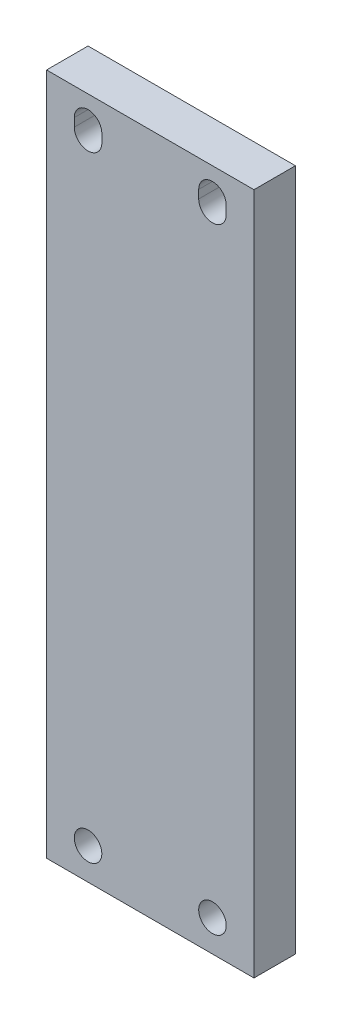
ISO-10303-21;
HEADER;
FILE_DESCRIPTION(('STEP AP214'),'2;1');
FILE_NAME('part.step','',(''),(''),'','','');
FILE_SCHEMA(('AUTOMOTIVE_DESIGN { 1 0 10303 214 1 1 1 1 }'));
ENDSEC;
DATA;
#1=APPLICATION_CONTEXT('core data for automotive mechanical design processes');
#2=APPLICATION_PROTOCOL_DEFINITION('international standard','automotive_design',2000,#1);
#3=PRODUCT_CONTEXT('',#1,'mechanical');
#4=PRODUCT('Part','Part','',(#3));
#5=PRODUCT_RELATED_PRODUCT_CATEGORY('part','',(#4));
#6=PRODUCT_DEFINITION_FORMATION('','',#4);
#7=PRODUCT_DEFINITION_CONTEXT('part definition',#1,'design');
#8=PRODUCT_DEFINITION('design','',#6,#7);
#9=PRODUCT_DEFINITION_SHAPE('','',#8);
#10=(LENGTH_UNIT() NAMED_UNIT(*) SI_UNIT(.MILLI.,.METRE.));
#11=(NAMED_UNIT(*) PLANE_ANGLE_UNIT() SI_UNIT($,.RADIAN.));
#12=(NAMED_UNIT(*) SI_UNIT($,.STERADIAN.) SOLID_ANGLE_UNIT());
#13=UNCERTAINTY_MEASURE_WITH_UNIT(LENGTH_MEASURE(1.E-05),#10,'distance_accuracy_value','');
#14=(GEOMETRIC_REPRESENTATION_CONTEXT(3) GLOBAL_UNCERTAINTY_ASSIGNED_CONTEXT((#13)) GLOBAL_UNIT_ASSIGNED_CONTEXT((#10,
#11,#12)) REPRESENTATION_CONTEXT('',''));
#15=CARTESIAN_POINT('',(0.,0.,0.));
#16=DIRECTION('',(0.,0.,1.));
#17=DIRECTION('',(1.,0.,0.));
#18=AXIS2_PLACEMENT_3D('',#15,#16,#17);
#19=CARTESIAN_POINT('',(-31.75,104.521,6.35));
#20=DIRECTION('',(1.,0.,0.));
#21=DIRECTION('',(0.,1.,0.));
#22=AXIS2_PLACEMENT_3D('',#19,#20,#21);
#23=PLANE('',#22);
#24=DIRECTION('',(0.,-1.,0.));
#25=VECTOR('',#24,1.);
#26=CARTESIAN_POINT('',(-31.75,104.521,-6.35));
#27=LINE('',#26,#25);
#28=CARTESIAN_POINT('',(-31.75,104.521,-6.35));
#29=VERTEX_POINT('',#28);
#30=CARTESIAN_POINT('',(-31.75,-104.521,-6.35));
#31=VERTEX_POINT('',#30);
#32=EDGE_CURVE('E217',#29,#31,#27,.T.);
#33=ORIENTED_EDGE('',*,*,#32,.T.);
#34=DIRECTION('',(0.,0.,-1.));
#35=VECTOR('',#34,1.);
#36=CARTESIAN_POINT('',(-31.75,-104.521,6.35));
#37=LINE('',#36,#35);
#38=CARTESIAN_POINT('',(-31.75,-104.521,6.35));
#39=VERTEX_POINT('',#38);
#40=EDGE_CURVE('E13',#39,#31,#37,.T.);
#41=ORIENTED_EDGE('',*,*,#40,.F.);
#42=DIRECTION('',(0.,-1.,0.));
#43=VECTOR('',#42,1.);
#44=CARTESIAN_POINT('',(-31.75,104.521,6.35));
#45=LINE('',#44,#43);
#46=CARTESIAN_POINT('',(-31.75,104.521,6.35));
#47=VERTEX_POINT('',#46);
#48=EDGE_CURVE('E218',#47,#39,#45,.T.);
#49=ORIENTED_EDGE('',*,*,#48,.F.);
#50=DIRECTION('',(0.,0.,-1.));
#51=VECTOR('',#50,1.);
#52=CARTESIAN_POINT('',(-31.75,104.521,6.35));
#53=LINE('',#52,#51);
#54=EDGE_CURVE('E228',#47,#29,#53,.T.);
#55=ORIENTED_EDGE('',*,*,#54,.T.);
#56=EDGE_LOOP('',(#33,#41,#49,#55));
#57=FACE_BOUND('',#56,.T.);
#58=ADVANCED_FACE('F49',(#57),#23,.F.);
#59=CARTESIAN_POINT('',(-31.75,-104.521,6.35));
#60=DIRECTION('',(0.,1.,0.));
#61=DIRECTION('',(0.,0.,1.));
#62=AXIS2_PLACEMENT_3D('',#59,#60,#61);
#63=PLANE('',#62);
#64=DIRECTION('',(1.,0.,0.));
#65=VECTOR('',#64,1.);
#66=CARTESIAN_POINT('',(-31.75,-104.521,-6.35));
#67=LINE('',#66,#65);
#68=CARTESIAN_POINT('',(31.75,-104.521,-6.35));
#69=VERTEX_POINT('',#68);
#70=EDGE_CURVE('E231',#31,#69,#67,.T.);
#71=ORIENTED_EDGE('',*,*,#70,.T.);
#72=DIRECTION('',(0.,0.,-1.));
#73=VECTOR('',#72,1.);
#74=CARTESIAN_POINT('',(31.75,-104.521,6.35));
#75=LINE('',#74,#73);
#76=CARTESIAN_POINT('',(31.75,-104.521,6.35));
#77=VERTEX_POINT('',#76);
#78=EDGE_CURVE('E56',#77,#69,#75,.T.);
#79=ORIENTED_EDGE('',*,*,#78,.F.);
#80=DIRECTION('',(1.,0.,0.));
#81=VECTOR('',#80,1.);
#82=CARTESIAN_POINT('',(-31.75,-104.521,6.35));
#83=LINE('',#82,#81);
#84=EDGE_CURVE('E221',#39,#77,#83,.T.);
#85=ORIENTED_EDGE('',*,*,#84,.F.);
#86=ORIENTED_EDGE('',*,*,#40,.T.);
#87=EDGE_LOOP('',(#71,#79,#85,#86));
#88=FACE_BOUND('',#87,.T.);
#89=ADVANCED_FACE('F260',(#88),#63,.F.);
#90=CARTESIAN_POINT('',(31.75,104.521,6.35));
#91=DIRECTION('',(-1.,0.,0.));
#92=DIRECTION('',(0.,-1.,0.));
#93=AXIS2_PLACEMENT_3D('',#90,#91,#92);
#94=PLANE('',#93);
#95=DIRECTION('',(0.,1.,0.));
#96=VECTOR('',#95,1.);
#97=CARTESIAN_POINT('',(31.75,104.521,-6.35));
#98=LINE('',#97,#96);
#99=CARTESIAN_POINT('',(31.75,104.521,-6.35));
#100=VERTEX_POINT('',#99);
#101=EDGE_CURVE('E233',#69,#100,#98,.T.);
#102=ORIENTED_EDGE('',*,*,#101,.T.);
#103=DIRECTION('',(0.,0.,-1.));
#104=VECTOR('',#103,1.);
#105=CARTESIAN_POINT('',(31.75,104.521,6.35));
#106=LINE('',#105,#104);
#107=CARTESIAN_POINT('',(31.75,104.521,6.35));
#108=VERTEX_POINT('',#107);
#109=EDGE_CURVE('E238',#108,#100,#106,.T.);
#110=ORIENTED_EDGE('',*,*,#109,.F.);
#111=DIRECTION('',(0.,1.,0.));
#112=VECTOR('',#111,1.);
#113=CARTESIAN_POINT('',(31.75,104.521,6.35));
#114=LINE('',#113,#112);
#115=EDGE_CURVE('E224',#77,#108,#114,.T.);
#116=ORIENTED_EDGE('',*,*,#115,.F.);
#117=ORIENTED_EDGE('',*,*,#78,.T.);
#118=EDGE_LOOP('',(#102,#110,#116,#117));
#119=FACE_BOUND('',#118,.T.);
#120=ADVANCED_FACE('F245',(#119),#94,.F.);
#121=CARTESIAN_POINT('',(-31.75,104.521,6.35));
#122=DIRECTION('',(0.,-1.,0.));
#123=DIRECTION('',(0.,0.,-1.));
#124=AXIS2_PLACEMENT_3D('',#121,#122,#123);
#125=PLANE('',#124);
#126=DIRECTION('',(-1.,0.,0.));
#127=VECTOR('',#126,1.);
#128=CARTESIAN_POINT('',(-31.75,104.521,-6.35));
#129=LINE('',#128,#127);
#130=EDGE_CURVE('E222',#100,#29,#129,.T.);
#131=ORIENTED_EDGE('',*,*,#130,.T.);
#132=ORIENTED_EDGE('',*,*,#54,.F.);
#133=DIRECTION('',(-1.,0.,0.));
#134=VECTOR('',#133,1.);
#135=CARTESIAN_POINT('',(-31.75,104.521,6.35));
#136=LINE('',#135,#134);
#137=EDGE_CURVE('E226',#108,#47,#136,.T.);
#138=ORIENTED_EDGE('',*,*,#137,.F.);
#139=ORIENTED_EDGE('',*,*,#109,.T.);
#140=EDGE_LOOP('',(#131,#132,#138,#139));
#141=FACE_BOUND('',#140,.T.);
#142=ADVANCED_FACE('F253',(#141),#125,.F.);
#143=CARTESIAN_POINT('',(0.,0.,6.35));
#144=DIRECTION('',(0.,0.,1.));
#145=DIRECTION('',(1.,0.,0.));
#146=AXIS2_PLACEMENT_3D('',#143,#144,#145);
#147=PLANE('',#146);
#148=CARTESIAN_POINT('',(19.05,93.599,6.35));
#149=DIRECTION('',(0.,0.,1.));
#150=DIRECTION('',(-1.,0.,0.));
#151=AXIS2_PLACEMENT_3D('',#148,#149,#150);
#152=CIRCLE('',#151,4.2164);
#153=CARTESIAN_POINT('',(14.8336,93.599,6.35));
#154=VERTEX_POINT('',#153);
#155=CARTESIAN_POINT('',(23.2664,93.599,6.35));
#156=VERTEX_POINT('',#155);
#157=EDGE_CURVE('E63',#154,#156,#152,.T.);
#158=ORIENTED_EDGE('',*,*,#157,.F.);
#159=DIRECTION('',(0.,-1.,0.));
#160=VECTOR('',#159,1.);
#161=CARTESIAN_POINT('',(14.8336,93.599,6.35));
#162=LINE('',#161,#160);
#163=CARTESIAN_POINT('',(14.8336,96.139,6.35));
#164=VERTEX_POINT('',#163);
#165=EDGE_CURVE('E155',#164,#154,#162,.T.);
#166=ORIENTED_EDGE('',*,*,#165,.F.);
#167=CARTESIAN_POINT('',(19.05,96.139,6.35));
#168=DIRECTION('',(0.,0.,1.));
#169=DIRECTION('',(-1.,0.,0.));
#170=AXIS2_PLACEMENT_3D('',#167,#168,#169);
#171=CIRCLE('',#170,4.2164);
#172=CARTESIAN_POINT('',(23.2664,96.139,6.35));
#173=VERTEX_POINT('',#172);
#174=EDGE_CURVE('E158',#173,#164,#171,.T.);
#175=ORIENTED_EDGE('',*,*,#174,.F.);
#176=DIRECTION('',(0.,1.,0.));
#177=VECTOR('',#176,1.);
#178=CARTESIAN_POINT('',(23.2664,93.599,6.35));
#179=LINE('',#178,#177);
#180=EDGE_CURVE('E164',#156,#173,#179,.T.);
#181=ORIENTED_EDGE('',*,*,#180,.F.);
#182=EDGE_LOOP('',(#158,#166,#175,#181));
#183=FACE_BOUND('',#182,.T.);
#184=CARTESIAN_POINT('',(-19.05,93.599,6.35));
#185=DIRECTION('',(0.,0.,1.));
#186=DIRECTION('',(1.,0.,0.));
#187=AXIS2_PLACEMENT_3D('',#184,#185,#186);
#188=CIRCLE('',#187,4.2164);
#189=CARTESIAN_POINT('',(-23.2664,93.599,6.35));
#190=VERTEX_POINT('',#189);
#191=CARTESIAN_POINT('',(-14.8336,93.599,6.35));
#192=VERTEX_POINT('',#191);
#193=EDGE_CURVE('E170',#190,#192,#188,.T.);
#194=ORIENTED_EDGE('',*,*,#193,.F.);
#195=DIRECTION('',(0.,-1.,0.));
#196=VECTOR('',#195,1.);
#197=CARTESIAN_POINT('',(-23.2664,93.599,6.35));
#198=LINE('',#197,#196);
#199=CARTESIAN_POINT('',(-23.2664,96.139,6.35));
#200=VERTEX_POINT('',#199);
#201=EDGE_CURVE('E178',#200,#190,#198,.T.);
#202=ORIENTED_EDGE('',*,*,#201,.F.);
#203=CARTESIAN_POINT('',(-19.05,96.139,6.35));
#204=DIRECTION('',(0.,0.,1.));
#205=DIRECTION('',(1.,0.,0.));
#206=AXIS2_PLACEMENT_3D('',#203,#204,#205);
#207=CIRCLE('',#206,4.2164);
#208=CARTESIAN_POINT('',(-14.8336,96.139,6.35));
#209=VERTEX_POINT('',#208);
#210=EDGE_CURVE('E192',#209,#200,#207,.T.);
#211=ORIENTED_EDGE('',*,*,#210,.F.);
#212=DIRECTION('',(0.,1.,0.));
#213=VECTOR('',#212,1.);
#214=CARTESIAN_POINT('',(-14.8336,93.599,6.35));
#215=LINE('',#214,#213);
#216=EDGE_CURVE('E189',#192,#209,#215,.T.);
#217=ORIENTED_EDGE('',*,*,#216,.F.);
#218=EDGE_LOOP('',(#194,#202,#211,#217));
#219=FACE_BOUND('',#218,.T.);
#220=CARTESIAN_POINT('',(-19.05,-94.869,6.35));
#221=DIRECTION('',(0.,0.,1.));
#222=DIRECTION('',(1.,0.,0.));
#223=AXIS2_PLACEMENT_3D('',#220,#221,#222);
#224=CIRCLE('',#223,4.2164);
#225=CARTESIAN_POINT('',(-14.8336,-94.869,6.35));
#226=VERTEX_POINT('',#225);
#227=EDGE_CURVE('E199',#226,#226,#224,.T.);
#228=ORIENTED_EDGE('',*,*,#227,.F.);
#229=EDGE_LOOP('',(#228));
#230=FACE_BOUND('',#229,.T.);
#231=CARTESIAN_POINT('',(19.05,-94.869,6.35));
#232=DIRECTION('',(0.,0.,1.));
#233=DIRECTION('',(1.,0.,0.));
#234=AXIS2_PLACEMENT_3D('',#231,#232,#233);
#235=CIRCLE('',#234,4.2164);
#236=CARTESIAN_POINT('',(23.2664,-94.869,6.35));
#237=VERTEX_POINT('',#236);
#238=EDGE_CURVE('E211',#237,#237,#235,.T.);
#239=ORIENTED_EDGE('',*,*,#238,.F.);
#240=EDGE_LOOP('',(#239));
#241=FACE_BOUND('',#240,.T.);
#242=ORIENTED_EDGE('',*,*,#48,.T.);
#243=ORIENTED_EDGE('',*,*,#84,.T.);
#244=ORIENTED_EDGE('',*,*,#115,.T.);
#245=ORIENTED_EDGE('',*,*,#137,.T.);
#246=EDGE_LOOP('',(#242,#243,#244,#245));
#247=FACE_BOUND('',#246,.T.);
#248=ADVANCED_FACE('F259',(#183,#219,#230,#241,#247),#147,.T.);
#249=CARTESIAN_POINT('',(0.,0.,-6.35));
#250=DIRECTION('',(0.,0.,1.));
#251=DIRECTION('',(1.,0.,0.));
#252=AXIS2_PLACEMENT_3D('',#249,#250,#251);
#253=PLANE('',#252);
#254=DIRECTION('',(0.,-1.,0.));
#255=VECTOR('',#254,1.);
#256=CARTESIAN_POINT('',(14.8336,93.599,-6.35));
#257=LINE('',#256,#255);
#258=CARTESIAN_POINT('',(14.8336,96.139,-6.35));
#259=VERTEX_POINT('',#258);
#260=CARTESIAN_POINT('',(14.8336,93.599,-6.35));
#261=VERTEX_POINT('',#260);
#262=EDGE_CURVE('E145',#259,#261,#257,.T.);
#263=ORIENTED_EDGE('',*,*,#262,.T.);
#264=CARTESIAN_POINT('',(19.05,93.599,-6.35));
#265=DIRECTION('',(0.,0.,1.));
#266=DIRECTION('',(-1.,0.,0.));
#267=AXIS2_PLACEMENT_3D('',#264,#265,#266);
#268=CIRCLE('',#267,4.2164);
#269=CARTESIAN_POINT('',(23.2664,93.599,-6.35));
#270=VERTEX_POINT('',#269);
#271=EDGE_CURVE('E139',#261,#270,#268,.T.);
#272=ORIENTED_EDGE('',*,*,#271,.T.);
#273=DIRECTION('',(0.,1.,0.));
#274=VECTOR('',#273,1.);
#275=CARTESIAN_POINT('',(23.2664,93.599,-6.35));
#276=LINE('',#275,#274);
#277=CARTESIAN_POINT('',(23.2664,96.139,-6.35));
#278=VERTEX_POINT('',#277);
#279=EDGE_CURVE('E148',#270,#278,#276,.T.);
#280=ORIENTED_EDGE('',*,*,#279,.T.);
#281=CARTESIAN_POINT('',(19.05,96.139,-6.35));
#282=DIRECTION('',(0.,0.,1.));
#283=DIRECTION('',(-1.,0.,0.));
#284=AXIS2_PLACEMENT_3D('',#281,#282,#283);
#285=CIRCLE('',#284,4.2164);
#286=EDGE_CURVE('E71',#278,#259,#285,.T.);
#287=ORIENTED_EDGE('',*,*,#286,.T.);
#288=EDGE_LOOP('',(#263,#272,#280,#287));
#289=FACE_BOUND('',#288,.T.);
#290=DIRECTION('',(0.,-1.,0.));
#291=VECTOR('',#290,1.);
#292=CARTESIAN_POINT('',(-23.2664,93.599,-6.35));
#293=LINE('',#292,#291);
#294=CARTESIAN_POINT('',(-23.2664,96.139,-6.35));
#295=VERTEX_POINT('',#294);
#296=CARTESIAN_POINT('',(-23.2664,93.599,-6.35));
#297=VERTEX_POINT('',#296);
#298=EDGE_CURVE('E184',#295,#297,#293,.T.);
#299=ORIENTED_EDGE('',*,*,#298,.T.);
#300=CARTESIAN_POINT('',(-19.05,93.599,-6.35));
#301=DIRECTION('',(0.,0.,1.));
#302=DIRECTION('',(1.,0.,0.));
#303=AXIS2_PLACEMENT_3D('',#300,#301,#302);
#304=CIRCLE('',#303,4.2164);
#305=CARTESIAN_POINT('',(-14.8336,93.599,-6.35));
#306=VERTEX_POINT('',#305);
#307=EDGE_CURVE('E174',#297,#306,#304,.T.);
#308=ORIENTED_EDGE('',*,*,#307,.T.);
#309=DIRECTION('',(0.,1.,0.));
#310=VECTOR('',#309,1.);
#311=CARTESIAN_POINT('',(-14.8336,93.599,-6.35));
#312=LINE('',#311,#310);
#313=CARTESIAN_POINT('',(-14.8336,96.139,-6.35));
#314=VERTEX_POINT('',#313);
#315=EDGE_CURVE('E177',#306,#314,#312,.T.);
#316=ORIENTED_EDGE('',*,*,#315,.T.);
#317=CARTESIAN_POINT('',(-19.05,96.139,-6.35));
#318=DIRECTION('',(0.,0.,1.));
#319=DIRECTION('',(1.,0.,0.));
#320=AXIS2_PLACEMENT_3D('',#317,#318,#319);
#321=CIRCLE('',#320,4.2164);
#322=EDGE_CURVE('E181',#314,#295,#321,.T.);
#323=ORIENTED_EDGE('',*,*,#322,.T.);
#324=EDGE_LOOP('',(#299,#308,#316,#323));
#325=FACE_BOUND('',#324,.T.);
#326=CARTESIAN_POINT('',(-19.05,-94.869,-6.35));
#327=DIRECTION('',(0.,0.,1.));
#328=DIRECTION('',(1.,0.,0.));
#329=AXIS2_PLACEMENT_3D('',#326,#327,#328);
#330=CIRCLE('',#329,4.2164);
#331=CARTESIAN_POINT('',(-14.8336,-94.869,-6.35));
#332=VERTEX_POINT('',#331);
#333=EDGE_CURVE('E208',#332,#332,#330,.T.);
#334=ORIENTED_EDGE('',*,*,#333,.T.);
#335=EDGE_LOOP('',(#334));
#336=FACE_BOUND('',#335,.T.);
#337=CARTESIAN_POINT('',(19.05,-94.869,-6.35));
#338=DIRECTION('',(0.,0.,1.));
#339=DIRECTION('',(1.,0.,0.));
#340=AXIS2_PLACEMENT_3D('',#337,#338,#339);
#341=CIRCLE('',#340,4.2164);
#342=CARTESIAN_POINT('',(23.2664,-94.869,-6.35));
#343=VERTEX_POINT('',#342);
#344=EDGE_CURVE('E214',#343,#343,#341,.T.);
#345=ORIENTED_EDGE('',*,*,#344,.T.);
#346=EDGE_LOOP('',(#345));
#347=FACE_BOUND('',#346,.T.);
#348=ORIENTED_EDGE('',*,*,#32,.F.);
#349=ORIENTED_EDGE('',*,*,#130,.F.);
#350=ORIENTED_EDGE('',*,*,#101,.F.);
#351=ORIENTED_EDGE('',*,*,#70,.F.);
#352=EDGE_LOOP('',(#348,#349,#350,#351));
#353=FACE_BOUND('',#352,.T.);
#354=ADVANCED_FACE('F152',(#289,#325,#336,#347,#353),#253,.F.);
#355=CARTESIAN_POINT('',(19.05,-94.869,6.35));
#356=DIRECTION('',(0.,0.,1.));
#357=DIRECTION('',(1.,0.,0.));
#358=AXIS2_PLACEMENT_3D('',#355,#356,#357);
#359=CYLINDRICAL_SURFACE('',#358,4.2164);
#360=ORIENTED_EDGE('',*,*,#344,.F.);
#361=EDGE_LOOP('',(#360));
#362=FACE_BOUND('',#361,.T.);
#363=ORIENTED_EDGE('',*,*,#238,.T.);
#364=EDGE_LOOP('',(#363));
#365=FACE_BOUND('',#364,.T.);
#366=ADVANCED_FACE('F272',(#362,#365),#359,.F.);
#367=CARTESIAN_POINT('',(-19.05,-94.869,6.35));
#368=DIRECTION('',(0.,0.,1.));
#369=DIRECTION('',(1.,0.,0.));
#370=AXIS2_PLACEMENT_3D('',#367,#368,#369);
#371=CYLINDRICAL_SURFACE('',#370,4.2164);
#372=ORIENTED_EDGE('',*,*,#333,.F.);
#373=EDGE_LOOP('',(#372));
#374=FACE_BOUND('',#373,.T.);
#375=ORIENTED_EDGE('',*,*,#227,.T.);
#376=EDGE_LOOP('',(#375));
#377=FACE_BOUND('',#376,.T.);
#378=ADVANCED_FACE('F278',(#374,#377),#371,.F.);
#379=CARTESIAN_POINT('',(-19.05,93.599,-6.35));
#380=DIRECTION('',(0.,0.,1.));
#381=DIRECTION('',(1.,0.,0.));
#382=AXIS2_PLACEMENT_3D('',#379,#380,#381);
#383=CYLINDRICAL_SURFACE('',#382,4.2164);
#384=ORIENTED_EDGE('',*,*,#193,.T.);
#385=DIRECTION('',(0.,0.,1.));
#386=VECTOR('',#385,1.);
#387=CARTESIAN_POINT('',(-14.8336,93.599,-6.35));
#388=LINE('',#387,#386);
#389=EDGE_CURVE('E187',#306,#192,#388,.T.);
#390=ORIENTED_EDGE('',*,*,#389,.F.);
#391=ORIENTED_EDGE('',*,*,#307,.F.);
#392=DIRECTION('',(0.,0.,1.));
#393=VECTOR('',#392,1.);
#394=CARTESIAN_POINT('',(-23.2664,93.599,-6.35));
#395=LINE('',#394,#393);
#396=EDGE_CURVE('E197',#297,#190,#395,.T.);
#397=ORIENTED_EDGE('',*,*,#396,.T.);
#398=EDGE_LOOP('',(#384,#390,#391,#397));
#399=FACE_BOUND('',#398,.T.);
#400=ADVANCED_FACE('F282',(#399),#383,.F.);
#401=CARTESIAN_POINT('',(-23.2664,93.599,-6.35));
#402=DIRECTION('',(-1.,0.,0.));
#403=DIRECTION('',(0.,0.,1.));
#404=AXIS2_PLACEMENT_3D('',#401,#402,#403);
#405=PLANE('',#404);
#406=ORIENTED_EDGE('',*,*,#201,.T.);
#407=ORIENTED_EDGE('',*,*,#396,.F.);
#408=ORIENTED_EDGE('',*,*,#298,.F.);
#409=DIRECTION('',(0.,0.,1.));
#410=VECTOR('',#409,1.);
#411=CARTESIAN_POINT('',(-23.2664,96.139,-6.35));
#412=LINE('',#411,#410);
#413=EDGE_CURVE('E200',#295,#200,#412,.T.);
#414=ORIENTED_EDGE('',*,*,#413,.T.);
#415=EDGE_LOOP('',(#406,#407,#408,#414));
#416=FACE_BOUND('',#415,.T.);
#417=ADVANCED_FACE('F286',(#416),#405,.F.);
#418=CARTESIAN_POINT('',(-19.05,96.139,-6.35));
#419=DIRECTION('',(0.,0.,1.));
#420=DIRECTION('',(1.,0.,0.));
#421=AXIS2_PLACEMENT_3D('',#418,#419,#420);
#422=CYLINDRICAL_SURFACE('',#421,4.2164);
#423=ORIENTED_EDGE('',*,*,#210,.T.);
#424=ORIENTED_EDGE('',*,*,#413,.F.);
#425=ORIENTED_EDGE('',*,*,#322,.F.);
#426=DIRECTION('',(0.,0.,1.));
#427=VECTOR('',#426,1.);
#428=CARTESIAN_POINT('',(-14.8336,96.139,-6.35));
#429=LINE('',#428,#427);
#430=EDGE_CURVE('E202',#314,#209,#429,.T.);
#431=ORIENTED_EDGE('',*,*,#430,.T.);
#432=EDGE_LOOP('',(#423,#424,#425,#431));
#433=FACE_BOUND('',#432,.T.);
#434=ADVANCED_FACE('F291',(#433),#422,.F.);
#435=CARTESIAN_POINT('',(-14.8336,93.599,-6.35));
#436=DIRECTION('',(1.,0.,0.));
#437=DIRECTION('',(0.,0.,-1.));
#438=AXIS2_PLACEMENT_3D('',#435,#436,#437);
#439=PLANE('',#438);
#440=ORIENTED_EDGE('',*,*,#216,.T.);
#441=ORIENTED_EDGE('',*,*,#430,.F.);
#442=ORIENTED_EDGE('',*,*,#315,.F.);
#443=ORIENTED_EDGE('',*,*,#389,.T.);
#444=EDGE_LOOP('',(#440,#441,#442,#443));
#445=FACE_BOUND('',#444,.T.);
#446=ADVANCED_FACE('F288',(#445),#439,.F.);
#447=CARTESIAN_POINT('',(19.05,93.599,-6.35));
#448=DIRECTION('',(0.,0.,1.));
#449=DIRECTION('',(1.,0.,0.));
#450=AXIS2_PLACEMENT_3D('',#447,#448,#449);
#451=CYLINDRICAL_SURFACE('',#450,4.2164);
#452=ORIENTED_EDGE('',*,*,#157,.T.);
#453=DIRECTION('',(0.,0.,1.));
#454=VECTOR('',#453,1.);
#455=CARTESIAN_POINT('',(23.2664,93.599,-6.35));
#456=LINE('',#455,#454);
#457=EDGE_CURVE('E135',#270,#156,#456,.T.);
#458=ORIENTED_EDGE('',*,*,#457,.F.);
#459=ORIENTED_EDGE('',*,*,#271,.F.);
#460=DIRECTION('',(0.,0.,1.));
#461=VECTOR('',#460,1.);
#462=CARTESIAN_POINT('',(14.8336,93.599,-6.35));
#463=LINE('',#462,#461);
#464=EDGE_CURVE('E168',#261,#154,#463,.T.);
#465=ORIENTED_EDGE('',*,*,#464,.T.);
#466=EDGE_LOOP('',(#452,#458,#459,#465));
#467=FACE_BOUND('',#466,.T.);
#468=ADVANCED_FACE('F137',(#467),#451,.F.);
#469=CARTESIAN_POINT('',(14.8336,93.599,-6.35));
#470=DIRECTION('',(-1.,0.,0.));
#471=DIRECTION('',(0.,0.,1.));
#472=AXIS2_PLACEMENT_3D('',#469,#470,#471);
#473=PLANE('',#472);
#474=ORIENTED_EDGE('',*,*,#165,.T.);
#475=ORIENTED_EDGE('',*,*,#464,.F.);
#476=ORIENTED_EDGE('',*,*,#262,.F.);
#477=DIRECTION('',(0.,0.,1.));
#478=VECTOR('',#477,1.);
#479=CARTESIAN_POINT('',(14.8336,96.139,-6.35));
#480=LINE('',#479,#478);
#481=EDGE_CURVE('E171',#259,#164,#480,.T.);
#482=ORIENTED_EDGE('',*,*,#481,.T.);
#483=EDGE_LOOP('',(#474,#475,#476,#482));
#484=FACE_BOUND('',#483,.T.);
#485=ADVANCED_FACE('F301',(#484),#473,.F.);
#486=CARTESIAN_POINT('',(19.05,96.139,-6.35));
#487=DIRECTION('',(0.,0.,1.));
#488=DIRECTION('',(1.,0.,0.));
#489=AXIS2_PLACEMENT_3D('',#486,#487,#488);
#490=CYLINDRICAL_SURFACE('',#489,4.2164);
#491=ORIENTED_EDGE('',*,*,#174,.T.);
#492=ORIENTED_EDGE('',*,*,#481,.F.);
#493=ORIENTED_EDGE('',*,*,#286,.F.);
#494=DIRECTION('',(0.,0.,1.));
#495=VECTOR('',#494,1.);
#496=CARTESIAN_POINT('',(23.2664,96.139,-6.35));
#497=LINE('',#496,#495);
#498=EDGE_CURVE('E144',#278,#173,#497,.T.);
#499=ORIENTED_EDGE('',*,*,#498,.T.);
#500=EDGE_LOOP('',(#491,#492,#493,#499));
#501=FACE_BOUND('',#500,.T.);
#502=ADVANCED_FACE('F304',(#501),#490,.F.);
#503=CARTESIAN_POINT('',(23.2664,93.599,-6.35));
#504=DIRECTION('',(1.,0.,0.));
#505=DIRECTION('',(0.,0.,-1.));
#506=AXIS2_PLACEMENT_3D('',#503,#504,#505);
#507=PLANE('',#506);
#508=ORIENTED_EDGE('',*,*,#180,.T.);
#509=ORIENTED_EDGE('',*,*,#498,.F.);
#510=ORIENTED_EDGE('',*,*,#279,.F.);
#511=ORIENTED_EDGE('',*,*,#457,.T.);
#512=EDGE_LOOP('',(#508,#509,#510,#511));
#513=FACE_BOUND('',#512,.T.);
#514=ADVANCED_FACE('F149',(#513),#507,.F.);
#515=CLOSED_SHELL('',(#58,#89,#120,#142,#248,#354,#366,#378,#400,#417,#434,#446,#468,#485,#502,#514));
#516=MANIFOLD_SOLID_BREP('B2',#515);
#517=ADVANCED_BREP_SHAPE_REPRESENTATION('',(#18,#516),#14);
#518=SHAPE_DEFINITION_REPRESENTATION(#9,#517);
ENDSEC;
END-ISO-10303-21;
